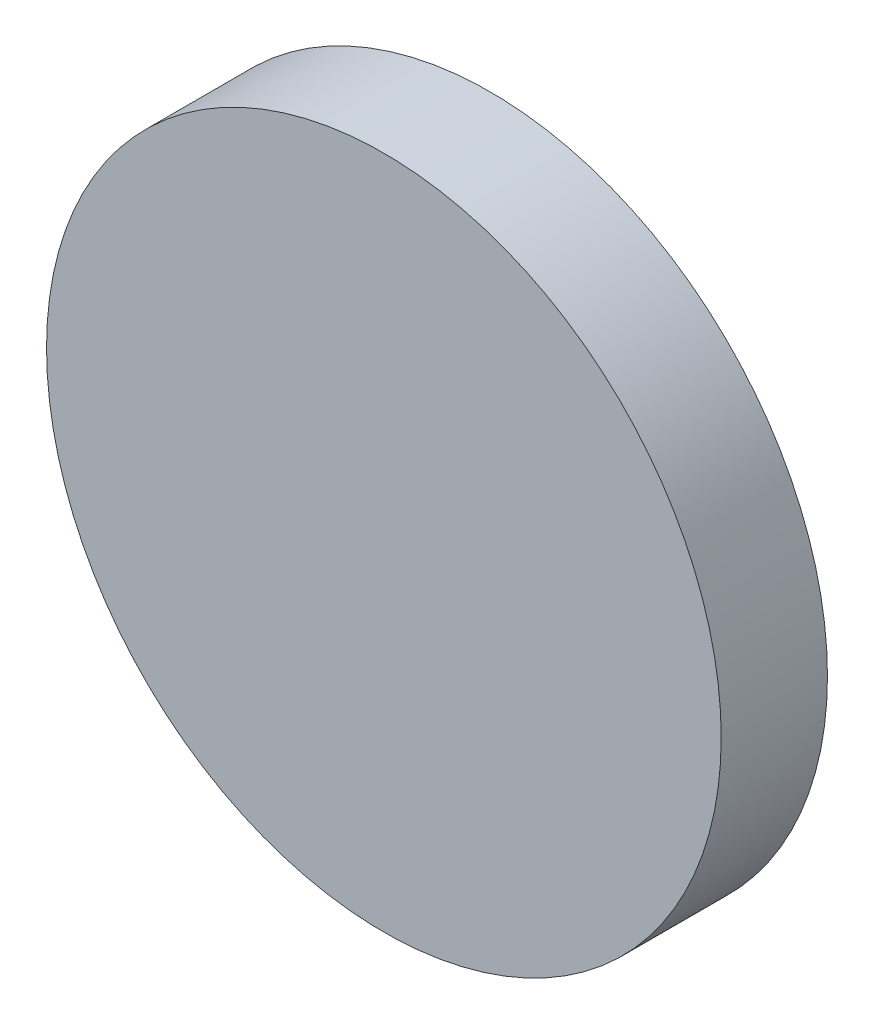
ISO-10303-21;
HEADER;
FILE_DESCRIPTION(('STEP AP214'),'2;1');
FILE_NAME('part.step','',(''),(''),'','','');
FILE_SCHEMA(('AUTOMOTIVE_DESIGN { 1 0 10303 214 1 1 1 1 }'));
ENDSEC;
DATA;
#1=APPLICATION_CONTEXT('core data for automotive mechanical design processes');
#2=APPLICATION_PROTOCOL_DEFINITION('international standard','automotive_design',2000,#1);
#3=PRODUCT_CONTEXT('',#1,'mechanical');
#4=PRODUCT('Part','Part','',(#3));
#5=PRODUCT_RELATED_PRODUCT_CATEGORY('part','',(#4));
#6=PRODUCT_DEFINITION_FORMATION('','',#4);
#7=PRODUCT_DEFINITION_CONTEXT('part definition',#1,'design');
#8=PRODUCT_DEFINITION('design','',#6,#7);
#9=PRODUCT_DEFINITION_SHAPE('','',#8);
#10=(LENGTH_UNIT() NAMED_UNIT(*) SI_UNIT(.MILLI.,.METRE.));
#11=(NAMED_UNIT(*) PLANE_ANGLE_UNIT() SI_UNIT($,.RADIAN.));
#12=(NAMED_UNIT(*) SI_UNIT($,.STERADIAN.) SOLID_ANGLE_UNIT());
#13=UNCERTAINTY_MEASURE_WITH_UNIT(LENGTH_MEASURE(1.E-05),#10,'distance_accuracy_value','');
#14=(GEOMETRIC_REPRESENTATION_CONTEXT(3) GLOBAL_UNCERTAINTY_ASSIGNED_CONTEXT((#13)) GLOBAL_UNIT_ASSIGNED_CONTEXT((#10,
#11,#12)) REPRESENTATION_CONTEXT('',''));
#15=CARTESIAN_POINT('',(0.,0.,0.));
#16=DIRECTION('',(0.,0.,1.));
#17=DIRECTION('',(1.,0.,0.));
#18=AXIS2_PLACEMENT_3D('',#15,#16,#17);
#19=CARTESIAN_POINT('',(0.,0.,4.));
#20=DIRECTION('',(0.,0.,-1.));
#21=DIRECTION('',(-1.,0.,0.));
#22=AXIS2_PLACEMENT_3D('',#19,#20,#21);
#23=CYLINDRICAL_SURFACE('',#22,12.7);
#24=CARTESIAN_POINT('',(0.,0.,4.));
#25=DIRECTION('',(0.,0.,1.));
#26=DIRECTION('',(1.,0.,0.));
#27=AXIS2_PLACEMENT_3D('',#24,#25,#26);
#28=CIRCLE('',#27,12.7);
#29=CARTESIAN_POINT('',(12.7,0.,4.));
#30=VERTEX_POINT('',#29);
#31=EDGE_CURVE('E10',#30,#30,#28,.T.);
#32=ORIENTED_EDGE('',*,*,#31,.F.);
#33=EDGE_LOOP('',(#32));
#34=FACE_BOUND('',#33,.T.);
#35=CARTESIAN_POINT('',(0.,0.,0.));
#36=DIRECTION('',(0.,0.,1.));
#37=DIRECTION('',(1.,0.,0.));
#38=AXIS2_PLACEMENT_3D('',#35,#36,#37);
#39=CIRCLE('',#38,12.7);
#40=CARTESIAN_POINT('',(12.7,0.,0.));
#41=VERTEX_POINT('',#40);
#42=EDGE_CURVE('E38',#41,#41,#39,.T.);
#43=ORIENTED_EDGE('',*,*,#42,.T.);
#44=EDGE_LOOP('',(#43));
#45=FACE_BOUND('',#44,.T.);
#46=ADVANCED_FACE('F35',(#34,#45),#23,.T.);
#47=CARTESIAN_POINT('',(0.,0.,4.));
#48=DIRECTION('',(0.,0.,1.));
#49=DIRECTION('',(1.,0.,0.));
#50=AXIS2_PLACEMENT_3D('',#47,#48,#49);
#51=PLANE('',#50);
#52=ORIENTED_EDGE('',*,*,#31,.T.);
#53=EDGE_LOOP('',(#52));
#54=FACE_BOUND('',#53,.T.);
#55=ADVANCED_FACE('F50',(#54),#51,.T.);
#56=CARTESIAN_POINT('',(0.,0.,0.));
#57=DIRECTION('',(0.,0.,1.));
#58=DIRECTION('',(1.,0.,0.));
#59=AXIS2_PLACEMENT_3D('',#56,#57,#58);
#60=PLANE('',#59);
#61=ORIENTED_EDGE('',*,*,#42,.F.);
#62=EDGE_LOOP('',(#61));
#63=FACE_BOUND('',#62,.T.);
#64=ADVANCED_FACE('F48',(#63),#60,.F.);
#65=CLOSED_SHELL('',(#46,#55,#64));
#66=MANIFOLD_SOLID_BREP('B2',#65);
#67=ADVANCED_BREP_SHAPE_REPRESENTATION('',(#18,#66),#14);
#68=SHAPE_DEFINITION_REPRESENTATION(#9,#67);
ENDSEC;
END-ISO-10303-21;
